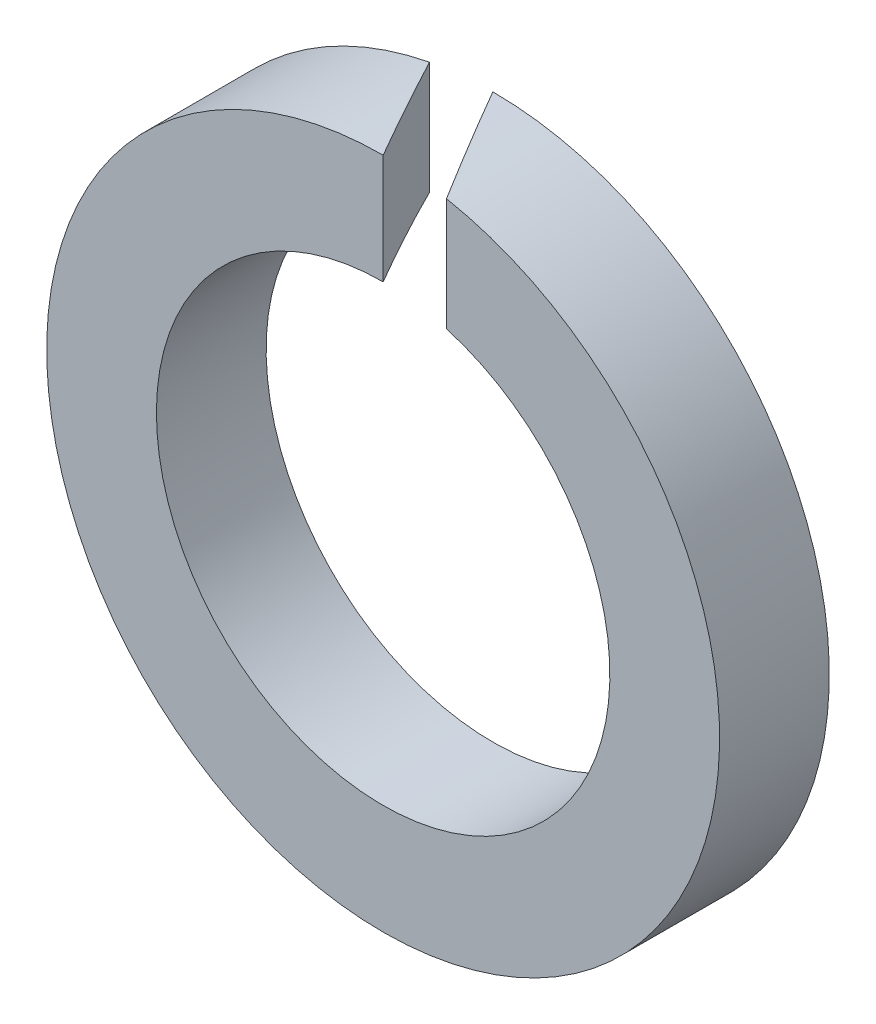
ISO-10303-21;
HEADER;
FILE_DESCRIPTION(('STEP AP214'),'2;1');
FILE_NAME('part.step','',(''),(''),'','','');
FILE_SCHEMA(('AUTOMOTIVE_DESIGN { 1 0 10303 214 1 1 1 1 }'));
ENDSEC;
DATA;
#1=APPLICATION_CONTEXT('core data for automotive mechanical design processes');
#2=APPLICATION_PROTOCOL_DEFINITION('international standard','automotive_design',2000,#1);
#3=PRODUCT_CONTEXT('',#1,'mechanical');
#4=PRODUCT('Part','Part','',(#3));
#5=PRODUCT_RELATED_PRODUCT_CATEGORY('part','',(#4));
#6=PRODUCT_DEFINITION_FORMATION('','',#4);
#7=PRODUCT_DEFINITION_CONTEXT('part definition',#1,'design');
#8=PRODUCT_DEFINITION('design','',#6,#7);
#9=PRODUCT_DEFINITION_SHAPE('','',#8);
#10=(LENGTH_UNIT() NAMED_UNIT(*) SI_UNIT(.MILLI.,.METRE.));
#11=(NAMED_UNIT(*) PLANE_ANGLE_UNIT() SI_UNIT($,.RADIAN.));
#12=(NAMED_UNIT(*) SI_UNIT($,.STERADIAN.) SOLID_ANGLE_UNIT());
#13=UNCERTAINTY_MEASURE_WITH_UNIT(LENGTH_MEASURE(1.E-05),#10,'distance_accuracy_value','');
#14=(GEOMETRIC_REPRESENTATION_CONTEXT(3) GLOBAL_UNCERTAINTY_ASSIGNED_CONTEXT((#13)) GLOBAL_UNIT_ASSIGNED_CONTEXT((#10,
#11,#12)) REPRESENTATION_CONTEXT('',''));
#15=CARTESIAN_POINT('',(0.,0.,0.));
#16=DIRECTION('',(0.,0.,1.));
#17=DIRECTION('',(1.,0.,0.));
#18=AXIS2_PLACEMENT_3D('',#15,#16,#17);
#19=CARTESIAN_POINT('',(0.,0.,2.1));
#20=DIRECTION('',(0.,0.,1.));
#21=DIRECTION('',(1.,0.,0.));
#22=AXIS2_PLACEMENT_3D('',#19,#20,#21);
#23=PLANE('',#22);
#24=CARTESIAN_POINT('',(0.,0.,2.1));
#25=DIRECTION('',(0.,0.,1.));
#26=DIRECTION('',(1.,0.,0.));
#27=AXIS2_PLACEMENT_3D('',#24,#25,#26);
#28=CIRCLE('',#27,4.34);
#29=CARTESIAN_POINT('',(1.66533453693773E-13,4.34000000000001,2.09999999999999));
#30=VERTEX_POINT('',#29);
#31=CARTESIAN_POINT('',(1.21243556529821,4.16720529851822,2.09999999999999));
#32=VERTEX_POINT('',#31);
#33=EDGE_CURVE('E91',#30,#32,#28,.T.);
#34=ORIENTED_EDGE('',*,*,#33,.F.);
#35=DIRECTION('',(0.,-1.,0.));
#36=VECTOR('',#35,1.);
#37=CARTESIAN_POINT('',(1.66533453693773E-13,6.44000000000022,2.09999999999999));
#38=LINE('',#37,#36);
#39=CARTESIAN_POINT('',(1.66533453693773E-13,6.44000000000022,2.09999999999999));
#40=VERTEX_POINT('',#39);
#41=EDGE_CURVE('E59',#40,#30,#38,.T.);
#42=ORIENTED_EDGE('',*,*,#41,.F.);
#43=CARTESIAN_POINT('',(0.,0.,2.1));
#44=DIRECTION('',(0.,0.,1.));
#45=DIRECTION('',(1.,0.,0.));
#46=AXIS2_PLACEMENT_3D('',#43,#44,#45);
#47=CIRCLE('',#46,6.44);
#48=CARTESIAN_POINT('',(1.21243556529826,6.32483991892263,2.09999999999999));
#49=VERTEX_POINT('',#48);
#50=EDGE_CURVE('E89',#40,#49,#47,.T.);
#51=ORIENTED_EDGE('',*,*,#50,.T.);
#52=DIRECTION('',(0.,-1.,0.));
#53=VECTOR('',#52,1.);
#54=CARTESIAN_POINT('',(1.21243556529832,6.44,2.09999999999999));
#55=LINE('',#54,#53);
#56=EDGE_CURVE('E92',#49,#32,#55,.T.);
#57=ORIENTED_EDGE('',*,*,#56,.T.);
#58=EDGE_LOOP('',(#34,#42,#51,#57));
#59=FACE_BOUND('',#58,.T.);
#60=ADVANCED_FACE('F36',(#59),#23,.T.);
#61=CARTESIAN_POINT('',(0.,0.,0.));
#62=DIRECTION('',(0.,0.,1.));
#63=DIRECTION('',(1.,0.,0.));
#64=AXIS2_PLACEMENT_3D('',#61,#62,#63);
#65=PLANE('',#64);
#66=DIRECTION('',(0.,-1.,0.));
#67=VECTOR('',#66,1.);
#68=CARTESIAN_POINT('',(-1.21243556529826,6.44,0.));
#69=LINE('',#68,#67);
#70=CARTESIAN_POINT('',(-1.21243556529804,6.32483991892319,0.));
#71=VERTEX_POINT('',#70);
#72=CARTESIAN_POINT('',(-1.21243556529815,4.16720529851855,0.));
#73=VERTEX_POINT('',#72);
#74=EDGE_CURVE('E77',#71,#73,#69,.T.);
#75=ORIENTED_EDGE('',*,*,#74,.T.);
#76=CARTESIAN_POINT('',(0.,0.,0.));
#77=DIRECTION('',(0.,0.,1.));
#78=DIRECTION('',(1.,0.,0.));
#79=AXIS2_PLACEMENT_3D('',#76,#77,#78);
#80=CIRCLE('',#79,4.34);
#81=CARTESIAN_POINT('',(1.11022302462516E-13,4.34000000000001,0.));
#82=VERTEX_POINT('',#81);
#83=EDGE_CURVE('E82',#73,#82,#80,.T.);
#84=ORIENTED_EDGE('',*,*,#83,.T.);
#85=DIRECTION('',(0.,-1.,0.));
#86=VECTOR('',#85,1.);
#87=CARTESIAN_POINT('',(1.66533453693773E-13,6.44000000000022,0.));
#88=LINE('',#87,#86);
#89=CARTESIAN_POINT('',(1.66533453693773E-13,6.44000000000022,0.));
#90=VERTEX_POINT('',#89);
#91=EDGE_CURVE('E51',#90,#82,#88,.T.);
#92=ORIENTED_EDGE('',*,*,#91,.F.);
#93=CARTESIAN_POINT('',(0.,0.,0.));
#94=DIRECTION('',(0.,0.,1.));
#95=DIRECTION('',(1.,0.,0.));
#96=AXIS2_PLACEMENT_3D('',#93,#94,#95);
#97=CIRCLE('',#96,6.44);
#98=EDGE_CURVE('E95',#71,#90,#97,.T.);
#99=ORIENTED_EDGE('',*,*,#98,.F.);
#100=EDGE_LOOP('',(#75,#84,#92,#99));
#101=FACE_BOUND('',#100,.T.);
#102=ADVANCED_FACE('F109',(#101),#65,.F.);
#103=CARTESIAN_POINT('',(0.,0.,2.1));
#104=DIRECTION('',(0.,0.,-1.));
#105=DIRECTION('',(-1.,0.,0.));
#106=AXIS2_PLACEMENT_3D('',#103,#104,#105);
#107=CYLINDRICAL_SURFACE('',#106,6.44);
#108=CARTESIAN_POINT('',(0.,0.,2.09999999999998));
#109=DIRECTION('',(0.866025403784438,0.,-0.500000000000004));
#110=DIRECTION('',(-0.500000000000006,0.,-0.866025403784437));
#111=AXIS2_PLACEMENT_3D('',#108,#109,#110);
#112=ELLIPSE('',#111,12.8799999999999,6.44);
#113=EDGE_CURVE('E74',#71,#40,#112,.T.);
#114=ORIENTED_EDGE('',*,*,#113,.F.);
#115=ORIENTED_EDGE('',*,*,#98,.T.);
#116=CARTESIAN_POINT('',(0.,0.,0.));
#117=DIRECTION('',(-0.866025403784438,0.,0.500000000000004));
#118=DIRECTION('',(-0.500000000000005,0.,-0.866025403784437));
#119=AXIS2_PLACEMENT_3D('',#116,#117,#118);
#120=ELLIPSE('',#119,12.8799999999999,6.44);
#121=EDGE_CURVE('E83',#49,#90,#120,.T.);
#122=ORIENTED_EDGE('',*,*,#121,.F.);
#123=ORIENTED_EDGE('',*,*,#50,.F.);
#124=EDGE_LOOP('',(#114,#115,#122,#123));
#125=FACE_BOUND('',#124,.T.);
#126=ADVANCED_FACE('F38',(#125),#107,.T.);
#127=CARTESIAN_POINT('',(0.,0.,2.1));
#128=DIRECTION('',(0.,0.,-1.));
#129=DIRECTION('',(-1.,0.,0.));
#130=AXIS2_PLACEMENT_3D('',#127,#128,#129);
#131=CYLINDRICAL_SURFACE('',#130,4.34);
#132=ORIENTED_EDGE('',*,*,#83,.F.);
#133=CARTESIAN_POINT('',(0.,0.,2.09999999999998));
#134=DIRECTION('',(0.866025403784438,0.,-0.500000000000004));
#135=DIRECTION('',(-0.500000000000006,0.,-0.866025403784437));
#136=AXIS2_PLACEMENT_3D('',#133,#134,#135);
#137=ELLIPSE('',#136,8.67999999999992,4.34);
#138=EDGE_CURVE('E11',#73,#30,#137,.T.);
#139=ORIENTED_EDGE('',*,*,#138,.T.);
#140=ORIENTED_EDGE('',*,*,#33,.T.);
#141=CARTESIAN_POINT('',(0.,0.,0.));
#142=DIRECTION('',(-0.866025403784438,0.,0.500000000000004));
#143=DIRECTION('',(-0.500000000000005,0.,-0.866025403784437));
#144=AXIS2_PLACEMENT_3D('',#141,#142,#143);
#145=ELLIPSE('',#144,8.67999999999993,4.34);
#146=EDGE_CURVE('E44',#32,#82,#145,.T.);
#147=ORIENTED_EDGE('',*,*,#146,.T.);
#148=EDGE_LOOP('',(#132,#139,#140,#147));
#149=FACE_BOUND('',#148,.T.);
#150=ADVANCED_FACE('F107',(#149),#131,.F.);
#151=CARTESIAN_POINT('',(1.66533453693773E-13,6.44000000000022,0.));
#152=DIRECTION('',(-0.866025403784438,0.,0.500000000000004));
#153=DIRECTION('',(0.500000000000005,0.,0.866025403784437));
#154=AXIS2_PLACEMENT_3D('',#151,#152,#153);
#155=PLANE('',#154);
#156=ORIENTED_EDGE('',*,*,#121,.T.);
#157=ORIENTED_EDGE('',*,*,#91,.T.);
#158=ORIENTED_EDGE('',*,*,#146,.F.);
#159=ORIENTED_EDGE('',*,*,#56,.F.);
#160=EDGE_LOOP('',(#156,#157,#158,#159));
#161=FACE_BOUND('',#160,.T.);
#162=ADVANCED_FACE('F119',(#161),#155,.T.);
#163=CARTESIAN_POINT('',(1.66533453693773E-13,6.44000000000022,2.09999999999999));
#164=DIRECTION('',(0.866025403784438,0.,-0.500000000000004));
#165=DIRECTION('',(-0.500000000000006,0.,-0.866025403784437));
#166=AXIS2_PLACEMENT_3D('',#163,#164,#165);
#167=PLANE('',#166);
#168=ORIENTED_EDGE('',*,*,#113,.T.);
#169=ORIENTED_EDGE('',*,*,#41,.T.);
#170=ORIENTED_EDGE('',*,*,#138,.F.);
#171=ORIENTED_EDGE('',*,*,#74,.F.);
#172=EDGE_LOOP('',(#168,#169,#170,#171));
#173=FACE_BOUND('',#172,.T.);
#174=ADVANCED_FACE('F75',(#173),#167,.T.);
#175=CLOSED_SHELL('',(#60,#102,#126,#150,#162,#174));
#176=MANIFOLD_SOLID_BREP('B2',#175);
#177=ADVANCED_BREP_SHAPE_REPRESENTATION('',(#18,#176),#14);
#178=SHAPE_DEFINITION_REPRESENTATION(#9,#177);
ENDSEC;
END-ISO-10303-21;
